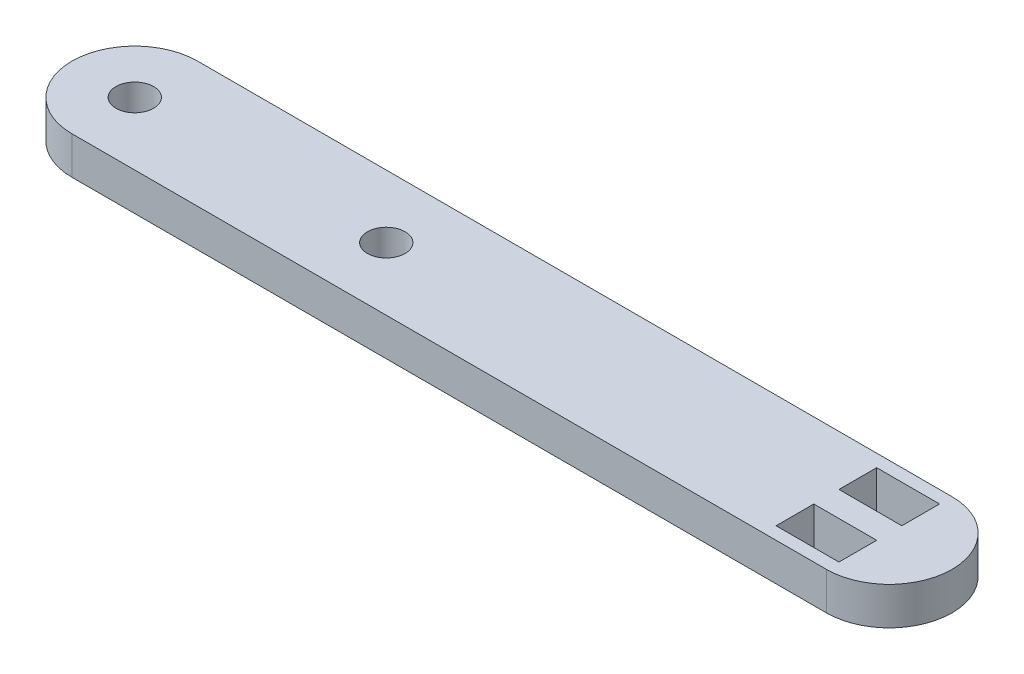
ISO-10303-21;
HEADER;
FILE_DESCRIPTION(('STEP AP214'),'2;1');
FILE_NAME('part.step','',(''),(''),'','','');
FILE_SCHEMA(('AUTOMOTIVE_DESIGN { 1 0 10303 214 1 1 1 1 }'));
ENDSEC;
DATA;
#1=APPLICATION_CONTEXT('core data for automotive mechanical design processes');
#2=APPLICATION_PROTOCOL_DEFINITION('international standard','automotive_design',2000,#1);
#3=PRODUCT_CONTEXT('',#1,'mechanical');
#4=PRODUCT('Part','Part','',(#3));
#5=PRODUCT_RELATED_PRODUCT_CATEGORY('part','',(#4));
#6=PRODUCT_DEFINITION_FORMATION('','',#4);
#7=PRODUCT_DEFINITION_CONTEXT('part definition',#1,'design');
#8=PRODUCT_DEFINITION('design','',#6,#7);
#9=PRODUCT_DEFINITION_SHAPE('','',#8);
#10=(LENGTH_UNIT() NAMED_UNIT(*) SI_UNIT(.MILLI.,.METRE.));
#11=(NAMED_UNIT(*) PLANE_ANGLE_UNIT() SI_UNIT($,.RADIAN.));
#12=(NAMED_UNIT(*) SI_UNIT($,.STERADIAN.) SOLID_ANGLE_UNIT());
#13=UNCERTAINTY_MEASURE_WITH_UNIT(LENGTH_MEASURE(1.E-05),#10,'distance_accuracy_value','');
#14=(GEOMETRIC_REPRESENTATION_CONTEXT(3) GLOBAL_UNCERTAINTY_ASSIGNED_CONTEXT((#13)) GLOBAL_UNIT_ASSIGNED_CONTEXT((#10,
#11,#12)) REPRESENTATION_CONTEXT('',''));
#15=CARTESIAN_POINT('',(0.,0.,0.));
#16=DIRECTION('',(0.,0.,1.));
#17=DIRECTION('',(1.,0.,0.));
#18=AXIS2_PLACEMENT_3D('',#15,#16,#17);
#19=CARTESIAN_POINT('',(0.,3.,-4.99999999999999));
#20=DIRECTION('',(0.,-1.,0.));
#21=DIRECTION('',(0.,0.,-1.));
#22=AXIS2_PLACEMENT_3D('',#19,#20,#21);
#23=PLANE('',#22);
#24=CARTESIAN_POINT('',(-40.,3.,-4.99999999999999));
#25=DIRECTION('',(0.,1.,0.));
#26=DIRECTION('',(0.,0.,1.));
#27=AXIS2_PLACEMENT_3D('',#24,#25,#26);
#28=CIRCLE('',#27,1.5);
#29=CARTESIAN_POINT('',(-40.,3.,-3.49999999999999));
#30=VERTEX_POINT('',#29);
#31=EDGE_CURVE('E158',#30,#30,#28,.T.);
#32=ORIENTED_EDGE('',*,*,#31,.F.);
#33=EDGE_LOOP('',(#32));
#34=FACE_BOUND('',#33,.T.);
#35=DIRECTION('',(0.,0.,-1.));
#36=VECTOR('',#35,1.);
#37=CARTESIAN_POINT('',(0.,3.,-6.));
#38=LINE('',#37,#36);
#39=CARTESIAN_POINT('',(0.,3.,-6.));
#40=VERTEX_POINT('',#39);
#41=CARTESIAN_POINT('',(0.,3.,-9.));
#42=VERTEX_POINT('',#41);
#43=EDGE_CURVE('E164',#40,#42,#38,.T.);
#44=ORIENTED_EDGE('',*,*,#43,.F.);
#45=DIRECTION('',(1.,0.,0.));
#46=VECTOR('',#45,1.);
#47=CARTESIAN_POINT('',(0.,3.,-6.));
#48=LINE('',#47,#46);
#49=CARTESIAN_POINT('',(-5.,3.,-6.));
#50=VERTEX_POINT('',#49);
#51=EDGE_CURVE('E172',#50,#40,#48,.T.);
#52=ORIENTED_EDGE('',*,*,#51,.F.);
#53=DIRECTION('',(0.,0.,1.));
#54=VECTOR('',#53,1.);
#55=CARTESIAN_POINT('',(-5.,3.,-6.));
#56=LINE('',#55,#54);
#57=CARTESIAN_POINT('',(-5.,3.,-9.));
#58=VERTEX_POINT('',#57);
#59=EDGE_CURVE('E169',#58,#50,#56,.T.);
#60=ORIENTED_EDGE('',*,*,#59,.F.);
#61=DIRECTION('',(-1.,0.,0.));
#62=VECTOR('',#61,1.);
#63=CARTESIAN_POINT('',(0.,3.,-9.));
#64=LINE('',#63,#62);
#65=EDGE_CURVE('E166',#42,#58,#64,.T.);
#66=ORIENTED_EDGE('',*,*,#65,.F.);
#67=EDGE_LOOP('',(#44,#52,#60,#66));
#68=FACE_BOUND('',#67,.T.);
#69=CARTESIAN_POINT('',(0.,3.,-4.99999999999999));
#70=DIRECTION('',(0.,1.,0.));
#71=DIRECTION('',(0.,0.,-1.));
#72=AXIS2_PLACEMENT_3D('',#69,#70,#71);
#73=CIRCLE('',#72,5.);
#74=CARTESIAN_POINT('',(0.,3.,0.));
#75=VERTEX_POINT('',#74);
#76=CARTESIAN_POINT('',(0.,3.,-10.));
#77=VERTEX_POINT('',#76);
#78=EDGE_CURVE('E201',#75,#77,#73,.T.);
#79=ORIENTED_EDGE('',*,*,#78,.T.);
#80=DIRECTION('',(-1.,0.,0.));
#81=VECTOR('',#80,1.);
#82=CARTESIAN_POINT('',(0.,3.,-10.));
#83=LINE('',#82,#81);
#84=CARTESIAN_POINT('',(-60.,3.,-9.99999999999999));
#85=VERTEX_POINT('',#84);
#86=EDGE_CURVE('E204',#77,#85,#83,.T.);
#87=ORIENTED_EDGE('',*,*,#86,.T.);
#88=CARTESIAN_POINT('',(-60.,3.,-4.99999999999999));
#89=DIRECTION('',(0.,1.,0.));
#90=DIRECTION('',(0.,0.,1.));
#91=AXIS2_PLACEMENT_3D('',#88,#89,#90);
#92=CIRCLE('',#91,5.);
#93=CARTESIAN_POINT('',(-60.,3.,0.));
#94=VERTEX_POINT('',#93);
#95=EDGE_CURVE('E207',#85,#94,#92,.T.);
#96=ORIENTED_EDGE('',*,*,#95,.T.);
#97=DIRECTION('',(1.,0.,0.));
#98=VECTOR('',#97,1.);
#99=CARTESIAN_POINT('',(0.,3.,0.));
#100=LINE('',#99,#98);
#101=EDGE_CURVE('E209',#94,#75,#100,.T.);
#102=ORIENTED_EDGE('',*,*,#101,.T.);
#103=EDGE_LOOP('',(#79,#87,#96,#102));
#104=FACE_BOUND('',#103,.T.);
#105=CARTESIAN_POINT('',(-60.,3.,-4.99999999999999));
#106=DIRECTION('',(0.,1.,0.));
#107=DIRECTION('',(0.,0.,1.));
#108=AXIS2_PLACEMENT_3D('',#105,#106,#107);
#109=CIRCLE('',#108,1.5);
#110=CARTESIAN_POINT('',(-60.,3.,-3.49999999999999));
#111=VERTEX_POINT('',#110);
#112=EDGE_CURVE('E195',#111,#111,#109,.T.);
#113=ORIENTED_EDGE('',*,*,#112,.F.);
#114=EDGE_LOOP('',(#113));
#115=FACE_BOUND('',#114,.T.);
#116=DIRECTION('',(0.,0.,-1.));
#117=VECTOR('',#116,1.);
#118=CARTESIAN_POINT('',(0.,3.,-3.99999999999999));
#119=LINE('',#118,#117);
#120=CARTESIAN_POINT('',(0.,3.,-0.99999999999999));
#121=VERTEX_POINT('',#120);
#122=CARTESIAN_POINT('',(0.,3.,-3.99999999999999));
#123=VERTEX_POINT('',#122);
#124=EDGE_CURVE('E122',#121,#123,#119,.T.);
#125=ORIENTED_EDGE('',*,*,#124,.F.);
#126=DIRECTION('',(1.,0.,0.));
#127=VECTOR('',#126,1.);
#128=CARTESIAN_POINT('',(0.,3.,-0.99999999999999));
#129=LINE('',#128,#127);
#130=CARTESIAN_POINT('',(-5.,3.,-0.99999999999999));
#131=VERTEX_POINT('',#130);
#132=EDGE_CURVE('E144',#131,#121,#129,.T.);
#133=ORIENTED_EDGE('',*,*,#132,.F.);
#134=DIRECTION('',(0.,0.,1.));
#135=VECTOR('',#134,1.);
#136=CARTESIAN_POINT('',(-5.,3.,-3.99999999999999));
#137=LINE('',#136,#135);
#138=CARTESIAN_POINT('',(-5.,3.,-3.99999999999999));
#139=VERTEX_POINT('',#138);
#140=EDGE_CURVE('E142',#139,#131,#137,.T.);
#141=ORIENTED_EDGE('',*,*,#140,.F.);
#142=DIRECTION('',(-1.,0.,0.));
#143=VECTOR('',#142,1.);
#144=CARTESIAN_POINT('',(0.,3.,-3.99999999999999));
#145=LINE('',#144,#143);
#146=EDGE_CURVE('E130',#123,#139,#145,.T.);
#147=ORIENTED_EDGE('',*,*,#146,.F.);
#148=EDGE_LOOP('',(#125,#133,#141,#147));
#149=FACE_BOUND('',#148,.T.);
#150=ADVANCED_FACE('F33',(#34,#68,#104,#115,#149),#23,.F.);
#151=CARTESIAN_POINT('',(0.,0.,-4.99999999999999));
#152=DIRECTION('',(0.,-1.,0.));
#153=DIRECTION('',(0.,0.,-1.));
#154=AXIS2_PLACEMENT_3D('',#151,#152,#153);
#155=PLANE('',#154);
#156=DIRECTION('',(1.,0.,0.));
#157=VECTOR('',#156,1.);
#158=CARTESIAN_POINT('',(0.,0.,-6.));
#159=LINE('',#158,#157);
#160=CARTESIAN_POINT('',(-5.,0.,-6.));
#161=VERTEX_POINT('',#160);
#162=CARTESIAN_POINT('',(0.,0.,-6.));
#163=VERTEX_POINT('',#162);
#164=EDGE_CURVE('E167',#161,#163,#159,.T.);
#165=ORIENTED_EDGE('',*,*,#164,.T.);
#166=DIRECTION('',(0.,0.,-1.));
#167=VECTOR('',#166,1.);
#168=CARTESIAN_POINT('',(0.,0.,-6.));
#169=LINE('',#168,#167);
#170=CARTESIAN_POINT('',(0.,0.,-9.));
#171=VERTEX_POINT('',#170);
#172=EDGE_CURVE('E161',#163,#171,#169,.T.);
#173=ORIENTED_EDGE('',*,*,#172,.T.);
#174=DIRECTION('',(-1.,0.,0.));
#175=VECTOR('',#174,1.);
#176=CARTESIAN_POINT('',(0.,0.,-9.));
#177=LINE('',#176,#175);
#178=CARTESIAN_POINT('',(-5.,0.,-9.));
#179=VERTEX_POINT('',#178);
#180=EDGE_CURVE('E177',#171,#179,#177,.T.);
#181=ORIENTED_EDGE('',*,*,#180,.T.);
#182=DIRECTION('',(0.,0.,1.));
#183=VECTOR('',#182,1.);
#184=CARTESIAN_POINT('',(-5.,0.,-6.));
#185=LINE('',#184,#183);
#186=EDGE_CURVE('E180',#179,#161,#185,.T.);
#187=ORIENTED_EDGE('',*,*,#186,.T.);
#188=EDGE_LOOP('',(#165,#173,#181,#187));
#189=FACE_BOUND('',#188,.T.);
#190=CARTESIAN_POINT('',(-60.,0.,-4.99999999999999));
#191=DIRECTION('',(0.,1.,0.));
#192=DIRECTION('',(0.,0.,1.));
#193=AXIS2_PLACEMENT_3D('',#190,#191,#192);
#194=CIRCLE('',#193,1.5);
#195=CARTESIAN_POINT('',(-60.,0.,-3.49999999999999));
#196=VERTEX_POINT('',#195);
#197=EDGE_CURVE('E194',#196,#196,#194,.T.);
#198=ORIENTED_EDGE('',*,*,#197,.T.);
#199=EDGE_LOOP('',(#198));
#200=FACE_BOUND('',#199,.T.);
#201=CARTESIAN_POINT('',(0.,0.,-4.99999999999999));
#202=DIRECTION('',(0.,1.,0.));
#203=DIRECTION('',(0.,0.,-1.));
#204=AXIS2_PLACEMENT_3D('',#201,#202,#203);
#205=CIRCLE('',#204,5.);
#206=CARTESIAN_POINT('',(0.,0.,0.));
#207=VERTEX_POINT('',#206);
#208=CARTESIAN_POINT('',(0.,0.,-10.));
#209=VERTEX_POINT('',#208);
#210=EDGE_CURVE('E198',#207,#209,#205,.T.);
#211=ORIENTED_EDGE('',*,*,#210,.F.);
#212=DIRECTION('',(1.,0.,0.));
#213=VECTOR('',#212,1.);
#214=CARTESIAN_POINT('',(0.,0.,0.));
#215=LINE('',#214,#213);
#216=CARTESIAN_POINT('',(-60.,0.,0.));
#217=VERTEX_POINT('',#216);
#218=EDGE_CURVE('E205',#217,#207,#215,.T.);
#219=ORIENTED_EDGE('',*,*,#218,.F.);
#220=CARTESIAN_POINT('',(-60.,0.,-4.99999999999999));
#221=DIRECTION('',(0.,1.,0.));
#222=DIRECTION('',(0.,0.,1.));
#223=AXIS2_PLACEMENT_3D('',#220,#221,#222);
#224=CIRCLE('',#223,5.);
#225=CARTESIAN_POINT('',(-60.,0.,-9.99999999999999));
#226=VERTEX_POINT('',#225);
#227=EDGE_CURVE('E216',#226,#217,#224,.T.);
#228=ORIENTED_EDGE('',*,*,#227,.F.);
#229=DIRECTION('',(-1.,0.,0.));
#230=VECTOR('',#229,1.);
#231=CARTESIAN_POINT('',(0.,0.,-10.));
#232=LINE('',#231,#230);
#233=EDGE_CURVE('E214',#209,#226,#232,.T.);
#234=ORIENTED_EDGE('',*,*,#233,.F.);
#235=EDGE_LOOP('',(#211,#219,#228,#234));
#236=FACE_BOUND('',#235,.T.);
#237=CARTESIAN_POINT('',(-40.,0.,-4.99999999999999));
#238=DIRECTION('',(0.,1.,0.));
#239=DIRECTION('',(0.,0.,1.));
#240=AXIS2_PLACEMENT_3D('',#237,#238,#239);
#241=CIRCLE('',#240,1.5);
#242=CARTESIAN_POINT('',(-40.,0.,-3.49999999999999));
#243=VERTEX_POINT('',#242);
#244=EDGE_CURVE('E138',#243,#243,#241,.T.);
#245=ORIENTED_EDGE('',*,*,#244,.T.);
#246=EDGE_LOOP('',(#245));
#247=FACE_BOUND('',#246,.T.);
#248=DIRECTION('',(1.,0.,0.));
#249=VECTOR('',#248,1.);
#250=CARTESIAN_POINT('',(0.,0.,-0.99999999999999));
#251=LINE('',#250,#249);
#252=CARTESIAN_POINT('',(-5.,0.,-0.99999999999999));
#253=VERTEX_POINT('',#252);
#254=CARTESIAN_POINT('',(0.,0.,-0.99999999999999));
#255=VERTEX_POINT('',#254);
#256=EDGE_CURVE('E131',#253,#255,#251,.T.);
#257=ORIENTED_EDGE('',*,*,#256,.T.);
#258=DIRECTION('',(0.,0.,-1.));
#259=VECTOR('',#258,1.);
#260=CARTESIAN_POINT('',(0.,0.,-3.99999999999999));
#261=LINE('',#260,#259);
#262=CARTESIAN_POINT('',(0.,0.,-3.99999999999999));
#263=VERTEX_POINT('',#262);
#264=EDGE_CURVE('E56',#255,#263,#261,.T.);
#265=ORIENTED_EDGE('',*,*,#264,.T.);
#266=DIRECTION('',(-1.,0.,0.));
#267=VECTOR('',#266,1.);
#268=CARTESIAN_POINT('',(0.,0.,-3.99999999999999));
#269=LINE('',#268,#267);
#270=CARTESIAN_POINT('',(-5.,0.,-3.99999999999999));
#271=VERTEX_POINT('',#270);
#272=EDGE_CURVE('E137',#263,#271,#269,.T.);
#273=ORIENTED_EDGE('',*,*,#272,.T.);
#274=DIRECTION('',(0.,0.,1.));
#275=VECTOR('',#274,1.);
#276=CARTESIAN_POINT('',(-5.,0.,-3.99999999999999));
#277=LINE('',#276,#275);
#278=EDGE_CURVE('E150',#271,#253,#277,.T.);
#279=ORIENTED_EDGE('',*,*,#278,.T.);
#280=EDGE_LOOP('',(#257,#265,#273,#279));
#281=FACE_BOUND('',#280,.T.);
#282=ADVANCED_FACE('F234',(#189,#200,#236,#247,#281),#155,.T.);
#283=CARTESIAN_POINT('',(0.,3.,-4.99999999999999));
#284=DIRECTION('',(0.,-1.,0.));
#285=DIRECTION('',(0.,0.,-1.));
#286=AXIS2_PLACEMENT_3D('',#283,#284,#285);
#287=CYLINDRICAL_SURFACE('',#286,5.);
#288=ORIENTED_EDGE('',*,*,#210,.T.);
#289=DIRECTION('',(0.,-1.,0.));
#290=VECTOR('',#289,1.);
#291=CARTESIAN_POINT('',(0.,3.,-10.));
#292=LINE('',#291,#290);
#293=EDGE_CURVE('E11',#77,#209,#292,.T.);
#294=ORIENTED_EDGE('',*,*,#293,.F.);
#295=ORIENTED_EDGE('',*,*,#78,.F.);
#296=DIRECTION('',(0.,-1.,0.));
#297=VECTOR('',#296,1.);
#298=CARTESIAN_POINT('',(0.,3.,0.));
#299=LINE('',#298,#297);
#300=EDGE_CURVE('E211',#75,#207,#299,.T.);
#301=ORIENTED_EDGE('',*,*,#300,.T.);
#302=EDGE_LOOP('',(#288,#294,#295,#301));
#303=FACE_BOUND('',#302,.T.);
#304=ADVANCED_FACE('F35',(#303),#287,.T.);
#305=CARTESIAN_POINT('',(0.,3.,-10.));
#306=DIRECTION('',(0.,0.,1.));
#307=DIRECTION('',(1.,0.,0.));
#308=AXIS2_PLACEMENT_3D('',#305,#306,#307);
#309=PLANE('',#308);
#310=ORIENTED_EDGE('',*,*,#233,.T.);
#311=DIRECTION('',(0.,-1.,0.));
#312=VECTOR('',#311,1.);
#313=CARTESIAN_POINT('',(-60.,3.,-9.99999999999999));
#314=LINE('',#313,#312);
#315=EDGE_CURVE('E41',#85,#226,#314,.T.);
#316=ORIENTED_EDGE('',*,*,#315,.F.);
#317=ORIENTED_EDGE('',*,*,#86,.F.);
#318=ORIENTED_EDGE('',*,*,#293,.T.);
#319=EDGE_LOOP('',(#310,#316,#317,#318));
#320=FACE_BOUND('',#319,.T.);
#321=ADVANCED_FACE('F245',(#320),#309,.F.);
#322=CARTESIAN_POINT('',(-60.,3.,-4.99999999999999));
#323=DIRECTION('',(0.,-1.,0.));
#324=DIRECTION('',(0.,0.,-1.));
#325=AXIS2_PLACEMENT_3D('',#322,#323,#324);
#326=CYLINDRICAL_SURFACE('',#325,5.);
#327=ORIENTED_EDGE('',*,*,#227,.T.);
#328=DIRECTION('',(0.,-1.,0.));
#329=VECTOR('',#328,1.);
#330=CARTESIAN_POINT('',(-60.,3.,0.));
#331=LINE('',#330,#329);
#332=EDGE_CURVE('E221',#94,#217,#331,.T.);
#333=ORIENTED_EDGE('',*,*,#332,.F.);
#334=ORIENTED_EDGE('',*,*,#95,.F.);
#335=ORIENTED_EDGE('',*,*,#315,.T.);
#336=EDGE_LOOP('',(#327,#333,#334,#335));
#337=FACE_BOUND('',#336,.T.);
#338=ADVANCED_FACE('F228',(#337),#326,.T.);
#339=CARTESIAN_POINT('',(0.,3.,0.));
#340=DIRECTION('',(0.,0.,-1.));
#341=DIRECTION('',(-1.,0.,0.));
#342=AXIS2_PLACEMENT_3D('',#339,#340,#341);
#343=PLANE('',#342);
#344=ORIENTED_EDGE('',*,*,#218,.T.);
#345=ORIENTED_EDGE('',*,*,#300,.F.);
#346=ORIENTED_EDGE('',*,*,#101,.F.);
#347=ORIENTED_EDGE('',*,*,#332,.T.);
#348=EDGE_LOOP('',(#344,#345,#346,#347));
#349=FACE_BOUND('',#348,.T.);
#350=ADVANCED_FACE('F238',(#349),#343,.F.);
#351=CARTESIAN_POINT('',(-60.,3.,-4.99999999999999));
#352=DIRECTION('',(0.,-1.,0.));
#353=DIRECTION('',(0.,0.,-1.));
#354=AXIS2_PLACEMENT_3D('',#351,#352,#353);
#355=CYLINDRICAL_SURFACE('',#354,1.5);
#356=ORIENTED_EDGE('',*,*,#112,.T.);
#357=EDGE_LOOP('',(#356));
#358=FACE_BOUND('',#357,.T.);
#359=ORIENTED_EDGE('',*,*,#197,.F.);
#360=EDGE_LOOP('',(#359));
#361=FACE_BOUND('',#360,.T.);
#362=ADVANCED_FACE('F263',(#358,#361),#355,.F.);
#363=CARTESIAN_POINT('',(0.,3.,-6.));
#364=DIRECTION('',(-1.,0.,0.));
#365=DIRECTION('',(0.,0.,1.));
#366=AXIS2_PLACEMENT_3D('',#363,#364,#365);
#367=PLANE('',#366);
#368=ORIENTED_EDGE('',*,*,#172,.F.);
#369=DIRECTION('',(0.,-1.,0.));
#370=VECTOR('',#369,1.);
#371=CARTESIAN_POINT('',(0.,3.,-6.));
#372=LINE('',#371,#370);
#373=EDGE_CURVE('E174',#40,#163,#372,.T.);
#374=ORIENTED_EDGE('',*,*,#373,.F.);
#375=ORIENTED_EDGE('',*,*,#43,.T.);
#376=DIRECTION('',(0.,-1.,0.));
#377=VECTOR('',#376,1.);
#378=CARTESIAN_POINT('',(0.,3.,-9.));
#379=LINE('',#378,#377);
#380=EDGE_CURVE('E191',#42,#171,#379,.T.);
#381=ORIENTED_EDGE('',*,*,#380,.T.);
#382=EDGE_LOOP('',(#368,#374,#375,#381));
#383=FACE_BOUND('',#382,.T.);
#384=ADVANCED_FACE('F270',(#383),#367,.T.);
#385=CARTESIAN_POINT('',(0.,3.,-9.));
#386=DIRECTION('',(0.,0.,1.));
#387=DIRECTION('',(1.,0.,0.));
#388=AXIS2_PLACEMENT_3D('',#385,#386,#387);
#389=PLANE('',#388);
#390=ORIENTED_EDGE('',*,*,#180,.F.);
#391=ORIENTED_EDGE('',*,*,#380,.F.);
#392=ORIENTED_EDGE('',*,*,#65,.T.);
#393=DIRECTION('',(0.,-1.,0.));
#394=VECTOR('',#393,1.);
#395=CARTESIAN_POINT('',(-5.,3.,-9.));
#396=LINE('',#395,#394);
#397=EDGE_CURVE('E189',#58,#179,#396,.T.);
#398=ORIENTED_EDGE('',*,*,#397,.T.);
#399=EDGE_LOOP('',(#390,#391,#392,#398));
#400=FACE_BOUND('',#399,.T.);
#401=ADVANCED_FACE('F275',(#400),#389,.T.);
#402=CARTESIAN_POINT('',(-5.,3.,-6.));
#403=DIRECTION('',(1.,0.,0.));
#404=DIRECTION('',(0.,0.,-1.));
#405=AXIS2_PLACEMENT_3D('',#402,#403,#404);
#406=PLANE('',#405);
#407=ORIENTED_EDGE('',*,*,#186,.F.);
#408=ORIENTED_EDGE('',*,*,#397,.F.);
#409=ORIENTED_EDGE('',*,*,#59,.T.);
#410=DIRECTION('',(0.,-1.,0.));
#411=VECTOR('',#410,1.);
#412=CARTESIAN_POINT('',(-5.,3.,-6.));
#413=LINE('',#412,#411);
#414=EDGE_CURVE('E187',#50,#161,#413,.T.);
#415=ORIENTED_EDGE('',*,*,#414,.T.);
#416=EDGE_LOOP('',(#407,#408,#409,#415));
#417=FACE_BOUND('',#416,.T.);
#418=ADVANCED_FACE('F284',(#417),#406,.T.);
#419=CARTESIAN_POINT('',(0.,3.,-6.));
#420=DIRECTION('',(0.,0.,-1.));
#421=DIRECTION('',(-1.,0.,0.));
#422=AXIS2_PLACEMENT_3D('',#419,#420,#421);
#423=PLANE('',#422);
#424=ORIENTED_EDGE('',*,*,#164,.F.);
#425=ORIENTED_EDGE('',*,*,#414,.F.);
#426=ORIENTED_EDGE('',*,*,#51,.T.);
#427=ORIENTED_EDGE('',*,*,#373,.T.);
#428=EDGE_LOOP('',(#424,#425,#426,#427));
#429=FACE_BOUND('',#428,.T.);
#430=ADVANCED_FACE('F290',(#429),#423,.T.);
#431=CARTESIAN_POINT('',(-40.,3.,-4.99999999999999));
#432=DIRECTION('',(0.,-1.,0.));
#433=DIRECTION('',(0.,0.,-1.));
#434=AXIS2_PLACEMENT_3D('',#431,#432,#433);
#435=CYLINDRICAL_SURFACE('',#434,1.5);
#436=ORIENTED_EDGE('',*,*,#31,.T.);
#437=EDGE_LOOP('',(#436));
#438=FACE_BOUND('',#437,.T.);
#439=ORIENTED_EDGE('',*,*,#244,.F.);
#440=EDGE_LOOP('',(#439));
#441=FACE_BOUND('',#440,.T.);
#442=ADVANCED_FACE('F294',(#438,#441),#435,.F.);
#443=CARTESIAN_POINT('',(0.,3.,-3.99999999999999));
#444=DIRECTION('',(-1.,0.,0.));
#445=DIRECTION('',(0.,0.,1.));
#446=AXIS2_PLACEMENT_3D('',#443,#444,#445);
#447=PLANE('',#446);
#448=ORIENTED_EDGE('',*,*,#264,.F.);
#449=DIRECTION('',(0.,-1.,0.));
#450=VECTOR('',#449,1.);
#451=CARTESIAN_POINT('',(0.,3.,-0.99999999999999));
#452=LINE('',#451,#450);
#453=EDGE_CURVE('E126',#121,#255,#452,.T.);
#454=ORIENTED_EDGE('',*,*,#453,.F.);
#455=ORIENTED_EDGE('',*,*,#124,.T.);
#456=DIRECTION('',(0.,-1.,0.));
#457=VECTOR('',#456,1.);
#458=CARTESIAN_POINT('',(0.,3.,-3.99999999999999));
#459=LINE('',#458,#457);
#460=EDGE_CURVE('E125',#123,#263,#459,.T.);
#461=ORIENTED_EDGE('',*,*,#460,.T.);
#462=EDGE_LOOP('',(#448,#454,#455,#461));
#463=FACE_BOUND('',#462,.T.);
#464=ADVANCED_FACE('F124',(#463),#447,.T.);
#465=CARTESIAN_POINT('',(0.,3.,-3.99999999999999));
#466=DIRECTION('',(0.,0.,1.));
#467=DIRECTION('',(1.,0.,0.));
#468=AXIS2_PLACEMENT_3D('',#465,#466,#467);
#469=PLANE('',#468);
#470=ORIENTED_EDGE('',*,*,#272,.F.);
#471=ORIENTED_EDGE('',*,*,#460,.F.);
#472=ORIENTED_EDGE('',*,*,#146,.T.);
#473=DIRECTION('',(0.,-1.,0.));
#474=VECTOR('',#473,1.);
#475=CARTESIAN_POINT('',(-5.,3.,-3.99999999999999));
#476=LINE('',#475,#474);
#477=EDGE_CURVE('E139',#139,#271,#476,.T.);
#478=ORIENTED_EDGE('',*,*,#477,.T.);
#479=EDGE_LOOP('',(#470,#471,#472,#478));
#480=FACE_BOUND('',#479,.T.);
#481=ADVANCED_FACE('F134',(#480),#469,.T.);
#482=CARTESIAN_POINT('',(-5.,3.,-3.99999999999999));
#483=DIRECTION('',(1.,0.,0.));
#484=DIRECTION('',(0.,0.,-1.));
#485=AXIS2_PLACEMENT_3D('',#482,#483,#484);
#486=PLANE('',#485);
#487=ORIENTED_EDGE('',*,*,#278,.F.);
#488=ORIENTED_EDGE('',*,*,#477,.F.);
#489=ORIENTED_EDGE('',*,*,#140,.T.);
#490=DIRECTION('',(0.,-1.,0.));
#491=VECTOR('',#490,1.);
#492=CARTESIAN_POINT('',(-5.,3.,-0.99999999999999));
#493=LINE('',#492,#491);
#494=EDGE_CURVE('E48',#131,#253,#493,.T.);
#495=ORIENTED_EDGE('',*,*,#494,.T.);
#496=EDGE_LOOP('',(#487,#488,#489,#495));
#497=FACE_BOUND('',#496,.T.);
#498=ADVANCED_FACE('F303',(#497),#486,.T.);
#499=CARTESIAN_POINT('',(0.,3.,-0.99999999999999));
#500=DIRECTION('',(0.,0.,-1.));
#501=DIRECTION('',(-1.,0.,0.));
#502=AXIS2_PLACEMENT_3D('',#499,#500,#501);
#503=PLANE('',#502);
#504=ORIENTED_EDGE('',*,*,#256,.F.);
#505=ORIENTED_EDGE('',*,*,#494,.F.);
#506=ORIENTED_EDGE('',*,*,#132,.T.);
#507=ORIENTED_EDGE('',*,*,#453,.T.);
#508=EDGE_LOOP('',(#504,#505,#506,#507));
#509=FACE_BOUND('',#508,.T.);
#510=ADVANCED_FACE('F306',(#509),#503,.T.);
#511=CLOSED_SHELL('',(#150,#282,#304,#321,#338,#350,#362,#384,#401,#418,#430,#442,#464,#481,
#498,#510));
#512=MANIFOLD_SOLID_BREP('B2',#511);
#513=ADVANCED_BREP_SHAPE_REPRESENTATION('',(#18,#512),#14);
#514=SHAPE_DEFINITION_REPRESENTATION(#9,#513);
ENDSEC;
END-ISO-10303-21;
